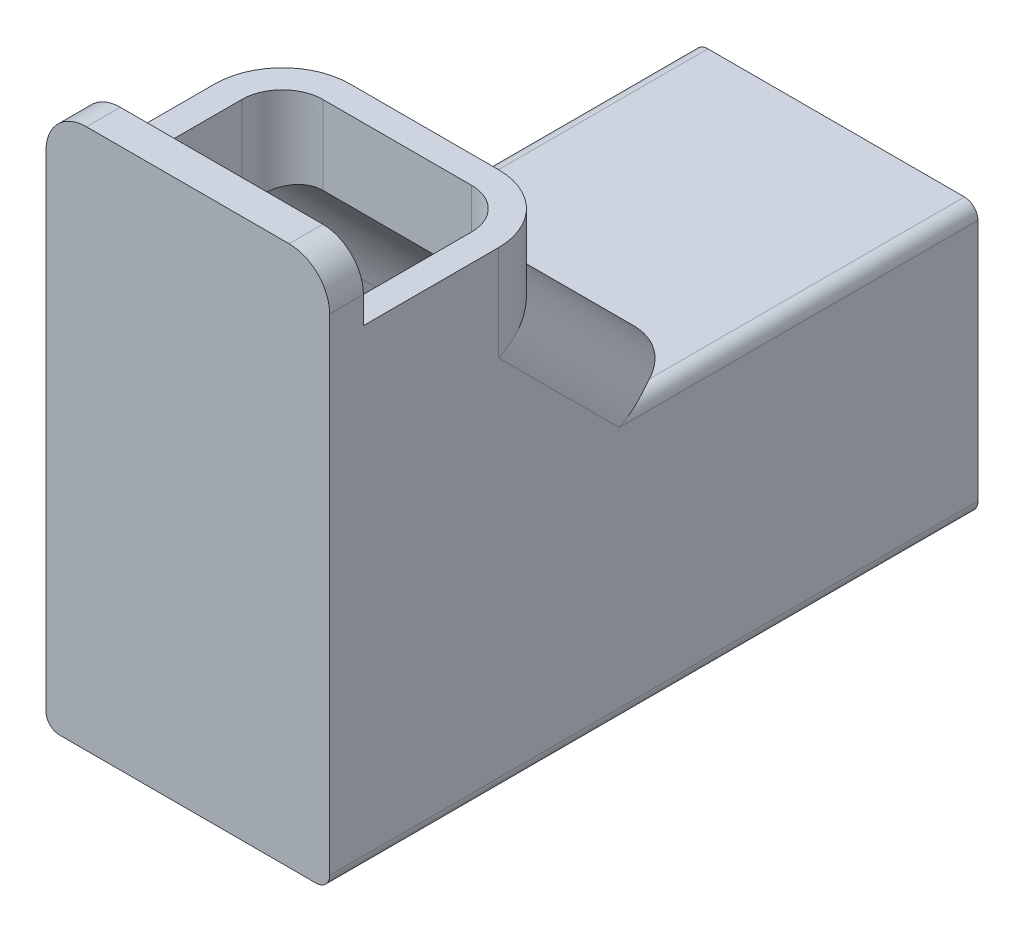
ISO-10303-21;
HEADER;
FILE_DESCRIPTION(('STEP AP214'),'2;1');
FILE_NAME('part.step','',(''),(''),'','','');
FILE_SCHEMA(('AUTOMOTIVE_DESIGN { 1 0 10303 214 1 1 1 1 }'));
ENDSEC;
DATA;
#1=APPLICATION_CONTEXT('core data for automotive mechanical design processes');
#2=APPLICATION_PROTOCOL_DEFINITION('international standard','automotive_design',2000,#1);
#3=PRODUCT_CONTEXT('',#1,'mechanical');
#4=PRODUCT('Part','Part','',(#3));
#5=PRODUCT_RELATED_PRODUCT_CATEGORY('part','',(#4));
#6=PRODUCT_DEFINITION_FORMATION('','',#4);
#7=PRODUCT_DEFINITION_CONTEXT('part definition',#1,'design');
#8=PRODUCT_DEFINITION('design','',#6,#7);
#9=PRODUCT_DEFINITION_SHAPE('','',#8);
#10=(LENGTH_UNIT() NAMED_UNIT(*) SI_UNIT(.MILLI.,.METRE.));
#11=(NAMED_UNIT(*) PLANE_ANGLE_UNIT() SI_UNIT($,.RADIAN.));
#12=(NAMED_UNIT(*) SI_UNIT($,.STERADIAN.) SOLID_ANGLE_UNIT());
#13=UNCERTAINTY_MEASURE_WITH_UNIT(LENGTH_MEASURE(1.E-05),#10,'distance_accuracy_value','');
#14=(GEOMETRIC_REPRESENTATION_CONTEXT(3) GLOBAL_UNCERTAINTY_ASSIGNED_CONTEXT((#13)) GLOBAL_UNIT_ASSIGNED_CONTEXT((#10,
#11,#12)) REPRESENTATION_CONTEXT('',''));
#15=CARTESIAN_POINT('',(0.,0.,0.));
#16=DIRECTION('',(0.,0.,1.));
#17=DIRECTION('',(1.,0.,0.));
#18=AXIS2_PLACEMENT_3D('',#15,#16,#17);
#19=CARTESIAN_POINT('',(21.,20.,-48.));
#20=DIRECTION('',(0.,0.,1.));
#21=DIRECTION('',(1.,0.,0.));
#22=AXIS2_PLACEMENT_3D('',#19,#20,#21);
#23=PLANE('',#22);
#24=DIRECTION('',(-1.,0.,0.));
#25=VECTOR('',#24,1.);
#26=CARTESIAN_POINT('',(21.,0.,-48.));
#27=LINE('',#26,#25);
#28=CARTESIAN_POINT('',(20.,0.,-48.));
#29=VERTEX_POINT('',#28);
#30=CARTESIAN_POINT('',(1.00000000000001,0.,-48.));
#31=VERTEX_POINT('',#30);
#32=EDGE_CURVE('E478',#29,#31,#27,.T.);
#33=ORIENTED_EDGE('',*,*,#32,.T.);
#34=CARTESIAN_POINT('',(1.,1.,-48.));
#35=DIRECTION('',(0.,0.,1.));
#36=DIRECTION('',(1.,0.,0.));
#37=AXIS2_PLACEMENT_3D('',#34,#35,#36);
#38=CIRCLE('',#37,1.);
#39=CARTESIAN_POINT('',(0.,1.,-48.));
#40=VERTEX_POINT('',#39);
#41=EDGE_CURVE('E498',#31,#40,#38,.F.);
#42=ORIENTED_EDGE('',*,*,#41,.T.);
#43=DIRECTION('',(0.,1.,0.));
#44=VECTOR('',#43,1.);
#45=CARTESIAN_POINT('',(0.,20.,-48.));
#46=LINE('',#45,#44);
#47=CARTESIAN_POINT('',(0.,19.,-48.));
#48=VERTEX_POINT('',#47);
#49=EDGE_CURVE('E415',#40,#48,#46,.T.);
#50=ORIENTED_EDGE('',*,*,#49,.T.);
#51=CARTESIAN_POINT('',(1.,19.,-48.));
#52=DIRECTION('',(0.,0.,1.));
#53=DIRECTION('',(1.,0.,0.));
#54=AXIS2_PLACEMENT_3D('',#51,#52,#53);
#55=CIRCLE('',#54,1.);
#56=CARTESIAN_POINT('',(1.00000000000001,20.,-48.));
#57=VERTEX_POINT('',#56);
#58=EDGE_CURVE('E492',#48,#57,#55,.F.);
#59=ORIENTED_EDGE('',*,*,#58,.T.);
#60=DIRECTION('',(-1.,0.,0.));
#61=VECTOR('',#60,1.);
#62=CARTESIAN_POINT('',(21.,20.,-48.));
#63=LINE('',#62,#61);
#64=CARTESIAN_POINT('',(20.,20.,-48.));
#65=VERTEX_POINT('',#64);
#66=EDGE_CURVE('E474',#65,#57,#63,.T.);
#67=ORIENTED_EDGE('',*,*,#66,.F.);
#68=CARTESIAN_POINT('',(20.,19.,-48.));
#69=DIRECTION('',(0.,0.,1.));
#70=DIRECTION('',(1.,0.,0.));
#71=AXIS2_PLACEMENT_3D('',#68,#69,#70);
#72=CIRCLE('',#71,1.);
#73=CARTESIAN_POINT('',(21.,19.,-48.));
#74=VERTEX_POINT('',#73);
#75=EDGE_CURVE('E489',#65,#74,#72,.F.);
#76=ORIENTED_EDGE('',*,*,#75,.T.);
#77=DIRECTION('',(0.,1.,0.));
#78=VECTOR('',#77,1.);
#79=CARTESIAN_POINT('',(21.,20.,-48.));
#80=LINE('',#79,#78);
#81=CARTESIAN_POINT('',(21.,1.,-48.));
#82=VERTEX_POINT('',#81);
#83=EDGE_CURVE('E416',#82,#74,#80,.T.);
#84=ORIENTED_EDGE('',*,*,#83,.F.);
#85=CARTESIAN_POINT('',(20.,1.,-48.));
#86=DIRECTION('',(0.,0.,1.));
#87=DIRECTION('',(1.,0.,0.));
#88=AXIS2_PLACEMENT_3D('',#85,#86,#87);
#89=CIRCLE('',#88,1.);
#90=EDGE_CURVE('E495',#82,#29,#89,.F.);
#91=ORIENTED_EDGE('',*,*,#90,.T.);
#92=EDGE_LOOP('',(#33,#42,#50,#59,#67,#76,#84,#91));
#93=FACE_BOUND('',#92,.T.);
#94=DIRECTION('',(-1.,0.,0.));
#95=VECTOR('',#94,1.);
#96=CARTESIAN_POINT('',(21.,2.,-48.));
#97=LINE('',#96,#95);
#98=CARTESIAN_POINT('',(19.,2.,-48.));
#99=VERTEX_POINT('',#98);
#100=CARTESIAN_POINT('',(2.,2.,-48.));
#101=VERTEX_POINT('',#100);
#102=EDGE_CURVE('E319',#99,#101,#97,.T.);
#103=ORIENTED_EDGE('',*,*,#102,.F.);
#104=DIRECTION('',(0.,1.,0.));
#105=VECTOR('',#104,1.);
#106=CARTESIAN_POINT('',(19.,0.,-48.));
#107=LINE('',#106,#105);
#108=CARTESIAN_POINT('',(19.,18.,-48.));
#109=VERTEX_POINT('',#108);
#110=EDGE_CURVE('E314',#99,#109,#107,.T.);
#111=ORIENTED_EDGE('',*,*,#110,.T.);
#112=DIRECTION('',(-1.,0.,0.));
#113=VECTOR('',#112,1.);
#114=CARTESIAN_POINT('',(21.,18.,-48.));
#115=LINE('',#114,#113);
#116=CARTESIAN_POINT('',(2.,18.,-48.));
#117=VERTEX_POINT('',#116);
#118=EDGE_CURVE('E59',#109,#117,#115,.T.);
#119=ORIENTED_EDGE('',*,*,#118,.T.);
#120=DIRECTION('',(0.,1.,0.));
#121=VECTOR('',#120,1.);
#122=CARTESIAN_POINT('',(2.,0.,-48.));
#123=LINE('',#122,#121);
#124=EDGE_CURVE('E392',#101,#117,#123,.T.);
#125=ORIENTED_EDGE('',*,*,#124,.F.);
#126=EDGE_LOOP('',(#103,#111,#119,#125));
#127=FACE_BOUND('',#126,.T.);
#128=ADVANCED_FACE('F40',(#93,#127),#23,.F.);
#129=CARTESIAN_POINT('',(21.,0.,-48.));
#130=DIRECTION('',(0.,1.,0.));
#131=DIRECTION('',(0.,0.,1.));
#132=AXIS2_PLACEMENT_3D('',#129,#130,#131);
#133=PLANE('',#132);
#134=DIRECTION('',(-1.,0.,0.));
#135=VECTOR('',#134,1.);
#136=CARTESIAN_POINT('',(21.,0.,0.));
#137=LINE('',#136,#135);
#138=CARTESIAN_POINT('',(20.,0.,0.));
#139=VERTEX_POINT('',#138);
#140=CARTESIAN_POINT('',(1.00000000000001,0.,0.));
#141=VERTEX_POINT('',#140);
#142=EDGE_CURVE('E431',#139,#141,#137,.T.);
#143=ORIENTED_EDGE('',*,*,#142,.T.);
#144=DIRECTION('',(0.,0.,-1.));
#145=VECTOR('',#144,1.);
#146=CARTESIAN_POINT('',(1.,0.,-48.));
#147=LINE('',#146,#145);
#148=EDGE_CURVE('E485',#141,#31,#147,.T.);
#149=ORIENTED_EDGE('',*,*,#148,.T.);
#150=ORIENTED_EDGE('',*,*,#32,.F.);
#151=DIRECTION('',(0.,0.,-1.));
#152=VECTOR('',#151,1.);
#153=CARTESIAN_POINT('',(20.,0.,-48.));
#154=LINE('',#153,#152);
#155=EDGE_CURVE('E482',#29,#139,#154,.F.);
#156=ORIENTED_EDGE('',*,*,#155,.T.);
#157=EDGE_LOOP('',(#143,#149,#150,#156));
#158=FACE_BOUND('',#157,.T.);
#159=ADVANCED_FACE('F623',(#158),#133,.F.);
#160=CARTESIAN_POINT('',(21.,20.,-27.5));
#161=DIRECTION('',(0.,-1.,0.));
#162=DIRECTION('',(0.,0.,-1.));
#163=AXIS2_PLACEMENT_3D('',#160,#161,#162);
#164=PLANE('',#163);
#165=ORIENTED_EDGE('',*,*,#66,.T.);
#166=DIRECTION('',(0.,0.,1.));
#167=VECTOR('',#166,1.);
#168=CARTESIAN_POINT('',(1.,20.,-27.5));
#169=LINE('',#168,#167);
#170=CARTESIAN_POINT('',(1.,20.,-24.6715728752538));
#171=VERTEX_POINT('',#170);
#172=EDGE_CURVE('E525',#57,#171,#169,.T.);
#173=ORIENTED_EDGE('',*,*,#172,.T.);
#174=CARTESIAN_POINT('',(5.,20.,-20.4289321881345));
#175=DIRECTION('',(0.,-1.,0.));
#176=DIRECTION('',(0.,0.,-1.));
#177=AXIS2_PLACEMENT_3D('',#174,#175,#176);
#178=ELLIPSE('',#177,7.07106781186546,5.);
#179=CARTESIAN_POINT('',(5.00000000000001,20.,-27.5));
#180=VERTEX_POINT('',#179);
#181=EDGE_CURVE('E578',#171,#180,#178,.T.);
#182=ORIENTED_EDGE('',*,*,#181,.T.);
#183=DIRECTION('',(-1.,0.,0.));
#184=VECTOR('',#183,1.);
#185=CARTESIAN_POINT('',(21.,20.,-27.5));
#186=LINE('',#185,#184);
#187=CARTESIAN_POINT('',(16.,20.,-27.5));
#188=VERTEX_POINT('',#187);
#189=EDGE_CURVE('E470',#188,#180,#186,.T.);
#190=ORIENTED_EDGE('',*,*,#189,.F.);
#191=CARTESIAN_POINT('',(16.,20.,-20.4289321881345));
#192=DIRECTION('',(0.,-1.,0.));
#193=DIRECTION('',(0.,0.,1.));
#194=AXIS2_PLACEMENT_3D('',#191,#192,#193);
#195=ELLIPSE('',#194,7.07106781186546,5.);
#196=CARTESIAN_POINT('',(20.,20.,-24.6715728752538));
#197=VERTEX_POINT('',#196);
#198=EDGE_CURVE('E608',#188,#197,#195,.T.);
#199=ORIENTED_EDGE('',*,*,#198,.T.);
#200=DIRECTION('',(0.,0.,1.));
#201=VECTOR('',#200,1.);
#202=CARTESIAN_POINT('',(20.,20.,-27.5));
#203=LINE('',#202,#201);
#204=EDGE_CURVE('E522',#197,#65,#203,.F.);
#205=ORIENTED_EDGE('',*,*,#204,.T.);
#206=EDGE_LOOP('',(#165,#173,#182,#190,#199,#205));
#207=FACE_BOUND('',#206,.T.);
#208=ADVANCED_FACE('F629',(#207),#164,.F.);
#209=CARTESIAN_POINT('',(21.,30.,-17.5));
#210=DIRECTION('',(0.,-0.707106781186546,0.707106781186549));
#211=DIRECTION('',(0.,-0.707106781186549,-0.707106781186546));
#212=AXIS2_PLACEMENT_3D('',#209,#210,#211);
#213=PLANE('',#212);
#214=ORIENTED_EDGE('',*,*,#189,.T.);
#215=DIRECTION('',(0.,0.707106781186549,0.707106781186546));
#216=VECTOR('',#215,1.);
#217=CARTESIAN_POINT('',(5.,35.,-12.5));
#218=LINE('',#217,#216);
#219=CARTESIAN_POINT('',(5.00000000000001,30.,-17.5));
#220=VERTEX_POINT('',#219);
#221=EDGE_CURVE('E546',#180,#220,#218,.T.);
#222=ORIENTED_EDGE('',*,*,#221,.T.);
#223=DIRECTION('',(-1.,0.,0.));
#224=VECTOR('',#223,1.);
#225=CARTESIAN_POINT('',(21.,30.,-17.5));
#226=LINE('',#225,#224);
#227=CARTESIAN_POINT('',(16.,30.,-17.5));
#228=VERTEX_POINT('',#227);
#229=EDGE_CURVE('E466',#228,#220,#226,.T.);
#230=ORIENTED_EDGE('',*,*,#229,.F.);
#231=DIRECTION('',(0.,0.707106781186549,0.707106781186546));
#232=VECTOR('',#231,1.);
#233=CARTESIAN_POINT('',(16.,30.,-17.5));
#234=LINE('',#233,#232);
#235=EDGE_CURVE('E543',#228,#188,#234,.F.);
#236=ORIENTED_EDGE('',*,*,#235,.T.);
#237=EDGE_LOOP('',(#214,#222,#230,#236));
#238=FACE_BOUND('',#237,.T.);
#239=ADVANCED_FACE('F722',(#238),#213,.F.);
#240=CARTESIAN_POINT('',(21.,35.,-17.5));
#241=DIRECTION('',(0.,0.,1.));
#242=DIRECTION('',(1.,0.,0.));
#243=AXIS2_PLACEMENT_3D('',#240,#241,#242);
#244=PLANE('',#243);
#245=ORIENTED_EDGE('',*,*,#229,.T.);
#246=DIRECTION('',(0.,1.,0.));
#247=VECTOR('',#246,1.);
#248=CARTESIAN_POINT('',(5.,35.,-17.5));
#249=LINE('',#248,#247);
#250=CARTESIAN_POINT('',(5.00000000000001,35.,-17.5));
#251=VERTEX_POINT('',#250);
#252=EDGE_CURVE('E532',#220,#251,#249,.T.);
#253=ORIENTED_EDGE('',*,*,#252,.T.);
#254=DIRECTION('',(-1.,0.,0.));
#255=VECTOR('',#254,1.);
#256=CARTESIAN_POINT('',(21.,35.,-17.5));
#257=LINE('',#256,#255);
#258=CARTESIAN_POINT('',(16.,35.,-17.5));
#259=VERTEX_POINT('',#258);
#260=EDGE_CURVE('E461',#259,#251,#257,.T.);
#261=ORIENTED_EDGE('',*,*,#260,.F.);
#262=DIRECTION('',(0.,1.,0.));
#263=VECTOR('',#262,1.);
#264=CARTESIAN_POINT('',(16.,35.,-17.5));
#265=LINE('',#264,#263);
#266=EDGE_CURVE('E528',#259,#228,#265,.F.);
#267=ORIENTED_EDGE('',*,*,#266,.T.);
#268=EDGE_LOOP('',(#245,#253,#261,#267));
#269=FACE_BOUND('',#268,.T.);
#270=ADVANCED_FACE('F717',(#269),#244,.F.);
#271=CARTESIAN_POINT('',(21.,35.,-2.5));
#272=DIRECTION('',(0.,-1.,0.));
#273=DIRECTION('',(0.,0.,-1.));
#274=AXIS2_PLACEMENT_3D('',#271,#272,#273);
#275=PLANE('',#274);
#276=DIRECTION('',(0.,0.,1.));
#277=VECTOR('',#276,1.);
#278=CARTESIAN_POINT('',(2.,35.,0.));
#279=LINE('',#278,#277);
#280=CARTESIAN_POINT('',(2.,35.,-12.5));
#281=VERTEX_POINT('',#280);
#282=CARTESIAN_POINT('',(2.,35.,-2.5));
#283=VERTEX_POINT('',#282);
#284=EDGE_CURVE('E315',#281,#283,#279,.T.);
#285=ORIENTED_EDGE('',*,*,#284,.F.);
#286=CARTESIAN_POINT('',(5.,35.,-12.5));
#287=DIRECTION('',(0.,-1.,0.));
#288=DIRECTION('',(0.,0.,-1.));
#289=AXIS2_PLACEMENT_3D('',#286,#287,#288);
#290=CIRCLE('',#289,3.);
#291=CARTESIAN_POINT('',(5.00000000000001,35.,-15.5));
#292=VERTEX_POINT('',#291);
#293=EDGE_CURVE('E372',#292,#281,#290,.F.);
#294=ORIENTED_EDGE('',*,*,#293,.F.);
#295=DIRECTION('',(-1.,0.,0.));
#296=VECTOR('',#295,1.);
#297=CARTESIAN_POINT('',(21.,35.,-15.5));
#298=LINE('',#297,#296);
#299=CARTESIAN_POINT('',(16.,35.,-15.5));
#300=VERTEX_POINT('',#299);
#301=EDGE_CURVE('E70',#300,#292,#298,.T.);
#302=ORIENTED_EDGE('',*,*,#301,.F.);
#303=CARTESIAN_POINT('',(16.,35.,-12.5));
#304=DIRECTION('',(0.,-1.,0.));
#305=DIRECTION('',(0.,0.,-1.));
#306=AXIS2_PLACEMENT_3D('',#303,#304,#305);
#307=CIRCLE('',#306,3.);
#308=CARTESIAN_POINT('',(19.,35.,-12.5));
#309=VERTEX_POINT('',#308);
#310=EDGE_CURVE('E376',#309,#300,#307,.F.);
#311=ORIENTED_EDGE('',*,*,#310,.F.);
#312=DIRECTION('',(0.,0.,1.));
#313=VECTOR('',#312,1.);
#314=CARTESIAN_POINT('',(19.,35.,0.));
#315=LINE('',#314,#313);
#316=CARTESIAN_POINT('',(19.,35.,-2.5));
#317=VERTEX_POINT('',#316);
#318=EDGE_CURVE('E336',#309,#317,#315,.T.);
#319=ORIENTED_EDGE('',*,*,#318,.T.);
#320=DIRECTION('',(-1.,0.,0.));
#321=VECTOR('',#320,1.);
#322=CARTESIAN_POINT('',(21.,35.,-2.5));
#323=LINE('',#322,#321);
#324=CARTESIAN_POINT('',(21.,35.,-2.5));
#325=VERTEX_POINT('',#324);
#326=EDGE_CURVE('E457',#325,#317,#323,.T.);
#327=ORIENTED_EDGE('',*,*,#326,.F.);
#328=DIRECTION('',(0.,0.,1.));
#329=VECTOR('',#328,1.);
#330=CARTESIAN_POINT('',(21.,35.,-2.5));
#331=LINE('',#330,#329);
#332=CARTESIAN_POINT('',(21.,35.,-12.5));
#333=VERTEX_POINT('',#332);
#334=EDGE_CURVE('E420',#333,#325,#331,.T.);
#335=ORIENTED_EDGE('',*,*,#334,.F.);
#336=CARTESIAN_POINT('',(16.,35.,-12.5));
#337=DIRECTION('',(0.,-1.,0.));
#338=DIRECTION('',(0.,0.,-1.));
#339=AXIS2_PLACEMENT_3D('',#336,#337,#338);
#340=CIRCLE('',#339,5.);
#341=EDGE_CURVE('E536',#333,#259,#340,.F.);
#342=ORIENTED_EDGE('',*,*,#341,.T.);
#343=ORIENTED_EDGE('',*,*,#260,.T.);
#344=CARTESIAN_POINT('',(5.,35.,-12.5));
#345=DIRECTION('',(0.,-1.,0.));
#346=DIRECTION('',(0.,0.,-1.));
#347=AXIS2_PLACEMENT_3D('',#344,#345,#346);
#348=CIRCLE('',#347,5.);
#349=CARTESIAN_POINT('',(0.,35.,-12.5));
#350=VERTEX_POINT('',#349);
#351=EDGE_CURVE('E539',#251,#350,#348,.F.);
#352=ORIENTED_EDGE('',*,*,#351,.T.);
#353=DIRECTION('',(0.,0.,1.));
#354=VECTOR('',#353,1.);
#355=CARTESIAN_POINT('',(0.,35.,-2.5));
#356=LINE('',#355,#354);
#357=CARTESIAN_POINT('',(0.,35.,-2.5));
#358=VERTEX_POINT('',#357);
#359=EDGE_CURVE('E435',#350,#358,#356,.T.);
#360=ORIENTED_EDGE('',*,*,#359,.T.);
#361=EDGE_CURVE('E456',#283,#358,#323,.T.);
#362=ORIENTED_EDGE('',*,*,#361,.F.);
#363=EDGE_LOOP('',(#285,#294,#302,#311,#319,#327,#335,#342,#343,#352,#360,#362));
#364=FACE_BOUND('',#363,.T.);
#365=ADVANCED_FACE('F714',(#364),#275,.F.);
#366=CARTESIAN_POINT('',(21.,40.,-2.5));
#367=DIRECTION('',(0.,0.,1.));
#368=DIRECTION('',(1.,0.,0.));
#369=AXIS2_PLACEMENT_3D('',#366,#367,#368);
#370=PLANE('',#369);
#371=DIRECTION('',(0.,1.,0.));
#372=VECTOR('',#371,1.);
#373=CARTESIAN_POINT('',(0.,40.,-2.5));
#374=LINE('',#373,#372);
#375=CARTESIAN_POINT('',(0.,37.,-2.5));
#376=VERTEX_POINT('',#375);
#377=EDGE_CURVE('E439',#358,#376,#374,.T.);
#378=ORIENTED_EDGE('',*,*,#377,.T.);
#379=CARTESIAN_POINT('',(3.,37.,-2.5));
#380=DIRECTION('',(0.,0.,1.));
#381=DIRECTION('',(1.,0.,0.));
#382=AXIS2_PLACEMENT_3D('',#379,#380,#381);
#383=CIRCLE('',#382,3.);
#384=CARTESIAN_POINT('',(3.00000000000001,40.,-2.5));
#385=VERTEX_POINT('',#384);
#386=EDGE_CURVE('E49',#376,#385,#383,.F.);
#387=ORIENTED_EDGE('',*,*,#386,.T.);
#388=DIRECTION('',(-1.,0.,0.));
#389=VECTOR('',#388,1.);
#390=CARTESIAN_POINT('',(21.,40.,-2.5));
#391=LINE('',#390,#389);
#392=CARTESIAN_POINT('',(18.,40.,-2.5));
#393=VERTEX_POINT('',#392);
#394=EDGE_CURVE('E452',#393,#385,#391,.T.);
#395=ORIENTED_EDGE('',*,*,#394,.F.);
#396=CARTESIAN_POINT('',(18.,37.,-2.5));
#397=DIRECTION('',(0.,0.,1.));
#398=DIRECTION('',(1.,0.,0.));
#399=AXIS2_PLACEMENT_3D('',#396,#397,#398);
#400=CIRCLE('',#399,3.);
#401=CARTESIAN_POINT('',(21.,37.,-2.5));
#402=VERTEX_POINT('',#401);
#403=EDGE_CURVE('E683',#393,#402,#400,.F.);
#404=ORIENTED_EDGE('',*,*,#403,.T.);
#405=DIRECTION('',(0.,1.,0.));
#406=VECTOR('',#405,1.);
#407=CARTESIAN_POINT('',(21.,40.,-2.5));
#408=LINE('',#407,#406);
#409=EDGE_CURVE('E424',#325,#402,#408,.T.);
#410=ORIENTED_EDGE('',*,*,#409,.F.);
#411=ORIENTED_EDGE('',*,*,#326,.T.);
#412=EDGE_CURVE('E462',#317,#283,#323,.T.);
#413=ORIENTED_EDGE('',*,*,#412,.T.);
#414=ORIENTED_EDGE('',*,*,#361,.T.);
#415=EDGE_LOOP('',(#378,#387,#395,#404,#410,#411,#413,#414));
#416=FACE_BOUND('',#415,.T.);
#417=ADVANCED_FACE('F703',(#416),#370,.F.);
#418=CARTESIAN_POINT('',(21.,40.,0.));
#419=DIRECTION('',(0.,-1.,0.));
#420=DIRECTION('',(0.,0.,-1.));
#421=AXIS2_PLACEMENT_3D('',#418,#419,#420);
#422=PLANE('',#421);
#423=ORIENTED_EDGE('',*,*,#394,.T.);
#424=DIRECTION('',(0.,0.,1.));
#425=VECTOR('',#424,1.);
#426=CARTESIAN_POINT('',(3.,40.,0.));
#427=LINE('',#426,#425);
#428=CARTESIAN_POINT('',(3.00000000000001,40.,0.));
#429=VERTEX_POINT('',#428);
#430=EDGE_CURVE('E688',#385,#429,#427,.T.);
#431=ORIENTED_EDGE('',*,*,#430,.T.);
#432=DIRECTION('',(-1.,0.,0.));
#433=VECTOR('',#432,1.);
#434=CARTESIAN_POINT('',(21.,40.,0.));
#435=LINE('',#434,#433);
#436=CARTESIAN_POINT('',(18.,40.,0.));
#437=VERTEX_POINT('',#436);
#438=EDGE_CURVE('E448',#437,#429,#435,.T.);
#439=ORIENTED_EDGE('',*,*,#438,.F.);
#440=DIRECTION('',(0.,0.,1.));
#441=VECTOR('',#440,1.);
#442=CARTESIAN_POINT('',(18.,40.,0.));
#443=LINE('',#442,#441);
#444=EDGE_CURVE('E607',#437,#393,#443,.F.);
#445=ORIENTED_EDGE('',*,*,#444,.T.);
#446=EDGE_LOOP('',(#423,#431,#439,#445));
#447=FACE_BOUND('',#446,.T.);
#448=ADVANCED_FACE('F709',(#447),#422,.F.);
#449=CARTESIAN_POINT('',(21.,0.,0.));
#450=DIRECTION('',(0.,0.,-1.));
#451=DIRECTION('',(-1.,0.,0.));
#452=AXIS2_PLACEMENT_3D('',#449,#450,#451);
#453=PLANE('',#452);
#454=ORIENTED_EDGE('',*,*,#438,.T.);
#455=CARTESIAN_POINT('',(3.,37.,0.));
#456=DIRECTION('',(0.,0.,-1.));
#457=DIRECTION('',(-1.,0.,0.));
#458=AXIS2_PLACEMENT_3D('',#455,#456,#457);
#459=CIRCLE('',#458,3.);
#460=CARTESIAN_POINT('',(0.,37.,0.));
#461=VERTEX_POINT('',#460);
#462=EDGE_CURVE('E687',#429,#461,#459,.F.);
#463=ORIENTED_EDGE('',*,*,#462,.T.);
#464=DIRECTION('',(0.,-1.,0.));
#465=VECTOR('',#464,1.);
#466=CARTESIAN_POINT('',(0.,0.,0.));
#467=LINE('',#466,#465);
#468=CARTESIAN_POINT('',(0.,1.,0.));
#469=VERTEX_POINT('',#468);
#470=EDGE_CURVE('E421',#461,#469,#467,.T.);
#471=ORIENTED_EDGE('',*,*,#470,.T.);
#472=CARTESIAN_POINT('',(1.,1.,0.));
#473=DIRECTION('',(0.,0.,-1.));
#474=DIRECTION('',(-1.,0.,0.));
#475=AXIS2_PLACEMENT_3D('',#472,#473,#474);
#476=CIRCLE('',#475,1.);
#477=EDGE_CURVE('E512',#469,#141,#476,.F.);
#478=ORIENTED_EDGE('',*,*,#477,.T.);
#479=ORIENTED_EDGE('',*,*,#142,.F.);
#480=CARTESIAN_POINT('',(20.,1.,0.));
#481=DIRECTION('',(0.,0.,-1.));
#482=DIRECTION('',(-1.,0.,0.));
#483=AXIS2_PLACEMENT_3D('',#480,#481,#482);
#484=CIRCLE('',#483,1.);
#485=CARTESIAN_POINT('',(21.,1.,0.));
#486=VERTEX_POINT('',#485);
#487=EDGE_CURVE('E508',#139,#486,#484,.F.);
#488=ORIENTED_EDGE('',*,*,#487,.T.);
#489=DIRECTION('',(0.,-1.,0.));
#490=VECTOR('',#489,1.);
#491=CARTESIAN_POINT('',(21.,0.,0.));
#492=LINE('',#491,#490);
#493=CARTESIAN_POINT('',(21.,37.,0.));
#494=VERTEX_POINT('',#493);
#495=EDGE_CURVE('E428',#494,#486,#492,.T.);
#496=ORIENTED_EDGE('',*,*,#495,.F.);
#497=CARTESIAN_POINT('',(18.,37.,0.));
#498=DIRECTION('',(0.,0.,-1.));
#499=DIRECTION('',(-1.,0.,0.));
#500=AXIS2_PLACEMENT_3D('',#497,#498,#499);
#501=CIRCLE('',#500,3.);
#502=EDGE_CURVE('E684',#494,#437,#501,.F.);
#503=ORIENTED_EDGE('',*,*,#502,.T.);
#504=EDGE_LOOP('',(#454,#463,#471,#478,#479,#488,#496,#503));
#505=FACE_BOUND('',#504,.T.);
#506=ADVANCED_FACE('F653',(#505),#453,.F.);
#507=CARTESIAN_POINT('',(21.,0.,0.));
#508=DIRECTION('',(-1.,0.,0.));
#509=DIRECTION('',(0.,0.,1.));
#510=AXIS2_PLACEMENT_3D('',#507,#508,#509);
#511=PLANE('',#510);
#512=ORIENTED_EDGE('',*,*,#409,.T.);
#513=DIRECTION('',(0.,0.,1.));
#514=VECTOR('',#513,1.);
#515=CARTESIAN_POINT('',(21.,37.,0.));
#516=LINE('',#515,#514);
#517=EDGE_CURVE('E11',#402,#494,#516,.T.);
#518=ORIENTED_EDGE('',*,*,#517,.T.);
#519=ORIENTED_EDGE('',*,*,#495,.T.);
#520=DIRECTION('',(0.,0.,-1.));
#521=VECTOR('',#520,1.);
#522=CARTESIAN_POINT('',(21.,1.,0.));
#523=LINE('',#522,#521);
#524=EDGE_CURVE('E518',#486,#82,#523,.T.);
#525=ORIENTED_EDGE('',*,*,#524,.T.);
#526=ORIENTED_EDGE('',*,*,#83,.T.);
#527=DIRECTION('',(0.,0.,1.));
#528=VECTOR('',#527,1.);
#529=CARTESIAN_POINT('',(21.,19.,0.));
#530=LINE('',#529,#528);
#531=CARTESIAN_POINT('',(21.,19.,-21.4289321881345));
#532=VERTEX_POINT('',#531);
#533=EDGE_CURVE('E515',#74,#532,#530,.T.);
#534=ORIENTED_EDGE('',*,*,#533,.T.);
#535=DIRECTION('',(0.,0.707106781186549,0.707106781186546));
#536=VECTOR('',#535,1.);
#537=CARTESIAN_POINT('',(21.,20.2144660940672,-20.2144660940673));
#538=LINE('',#537,#536);
#539=CARTESIAN_POINT('',(21.,27.9289321881345,-12.5));
#540=VERTEX_POINT('',#539);
#541=EDGE_CURVE('E558',#532,#540,#538,.T.);
#542=ORIENTED_EDGE('',*,*,#541,.T.);
#543=DIRECTION('',(0.,1.,0.));
#544=VECTOR('',#543,1.);
#545=CARTESIAN_POINT('',(21.,31.4644660940673,-12.5));
#546=LINE('',#545,#544);
#547=EDGE_CURVE('E562',#540,#333,#546,.T.);
#548=ORIENTED_EDGE('',*,*,#547,.T.);
#549=ORIENTED_EDGE('',*,*,#334,.T.);
#550=EDGE_LOOP('',(#512,#518,#519,#525,#526,#534,#542,#548,#549));
#551=FACE_BOUND('',#550,.T.);
#552=ADVANCED_FACE('F677',(#551),#511,.F.);
#553=CARTESIAN_POINT('',(0.,0.,0.));
#554=DIRECTION('',(-1.,0.,0.));
#555=DIRECTION('',(0.,0.,1.));
#556=AXIS2_PLACEMENT_3D('',#553,#554,#555);
#557=PLANE('',#556);
#558=ORIENTED_EDGE('',*,*,#470,.F.);
#559=DIRECTION('',(0.,0.,1.));
#560=VECTOR('',#559,1.);
#561=CARTESIAN_POINT('',(0.,37.,-2.5));
#562=LINE('',#561,#560);
#563=EDGE_CURVE('E691',#461,#376,#562,.F.);
#564=ORIENTED_EDGE('',*,*,#563,.T.);
#565=ORIENTED_EDGE('',*,*,#377,.F.);
#566=ORIENTED_EDGE('',*,*,#359,.F.);
#567=DIRECTION('',(0.,-1.,0.));
#568=VECTOR('',#567,1.);
#569=CARTESIAN_POINT('',(0.,31.4644660940673,-12.5));
#570=LINE('',#569,#568);
#571=CARTESIAN_POINT('',(0.,27.9289321881345,-12.5));
#572=VERTEX_POINT('',#571);
#573=EDGE_CURVE('E554',#350,#572,#570,.T.);
#574=ORIENTED_EDGE('',*,*,#573,.T.);
#575=DIRECTION('',(0.,0.707106781186549,0.707106781186546));
#576=VECTOR('',#575,1.);
#577=CARTESIAN_POINT('',(0.,15.4644660940673,-24.9644660940672));
#578=LINE('',#577,#576);
#579=CARTESIAN_POINT('',(0.,19.,-21.4289321881345));
#580=VERTEX_POINT('',#579);
#581=EDGE_CURVE('E550',#572,#580,#578,.F.);
#582=ORIENTED_EDGE('',*,*,#581,.T.);
#583=DIRECTION('',(0.,0.,1.));
#584=VECTOR('',#583,1.);
#585=CARTESIAN_POINT('',(0.,19.,-48.));
#586=LINE('',#585,#584);
#587=EDGE_CURVE('E501',#580,#48,#586,.F.);
#588=ORIENTED_EDGE('',*,*,#587,.T.);
#589=ORIENTED_EDGE('',*,*,#49,.F.);
#590=DIRECTION('',(0.,0.,-1.));
#591=VECTOR('',#590,1.);
#592=CARTESIAN_POINT('',(0.,1.,0.));
#593=LINE('',#592,#591);
#594=EDGE_CURVE('E504',#40,#469,#593,.F.);
#595=ORIENTED_EDGE('',*,*,#594,.T.);
#596=EDGE_LOOP('',(#558,#564,#565,#566,#574,#582,#588,#589,#595));
#597=FACE_BOUND('',#596,.T.);
#598=ADVANCED_FACE('F639',(#597),#557,.T.);
#599=CARTESIAN_POINT('',(1.,1.,-48.));
#600=DIRECTION('',(0.,0.,1.));
#601=DIRECTION('',(1.,0.,0.));
#602=AXIS2_PLACEMENT_3D('',#599,#600,#601);
#603=CYLINDRICAL_SURFACE('',#602,1.);
#604=ORIENTED_EDGE('',*,*,#477,.F.);
#605=ORIENTED_EDGE('',*,*,#594,.F.);
#606=ORIENTED_EDGE('',*,*,#41,.F.);
#607=ORIENTED_EDGE('',*,*,#148,.F.);
#608=EDGE_LOOP('',(#604,#605,#606,#607));
#609=FACE_BOUND('',#608,.T.);
#610=ADVANCED_FACE('F636',(#609),#603,.T.);
#611=CARTESIAN_POINT('',(20.,1.,0.));
#612=DIRECTION('',(0.,0.,-1.));
#613=DIRECTION('',(-1.,0.,0.));
#614=AXIS2_PLACEMENT_3D('',#611,#612,#613);
#615=CYLINDRICAL_SURFACE('',#614,1.);
#616=ORIENTED_EDGE('',*,*,#487,.F.);
#617=ORIENTED_EDGE('',*,*,#155,.F.);
#618=ORIENTED_EDGE('',*,*,#90,.F.);
#619=ORIENTED_EDGE('',*,*,#524,.F.);
#620=EDGE_LOOP('',(#616,#617,#618,#619));
#621=FACE_BOUND('',#620,.T.);
#622=ADVANCED_FACE('F638',(#621),#615,.T.);
#623=CARTESIAN_POINT('',(1.,19.,-27.5));
#624=DIRECTION('',(0.,0.,-1.));
#625=DIRECTION('',(-1.,0.,0.));
#626=AXIS2_PLACEMENT_3D('',#623,#624,#625);
#627=CYLINDRICAL_SURFACE('',#626,1.);
#628=ORIENTED_EDGE('',*,*,#58,.F.);
#629=ORIENTED_EDGE('',*,*,#587,.F.);
#630=CARTESIAN_POINT('',(1.,20.,-24.6715728752538));
#631=CARTESIAN_POINT('',(0.96841000100653,20.0000011285585,-24.6120098643487));
#632=CARTESIAN_POINT('',(0.93702025074834,19.9985029780137,-24.5523532885781));
#633=CARTESIAN_POINT('',(0.874872781159741,19.9926313141774,-24.4328624030505));
#634=CARTESIAN_POINT('',(0.844114976967454,19.9882581895935,-24.373028118409));
#635=CARTESIAN_POINT('',(0.753183799883374,19.9710218169383,-24.1933669197558));
#636=CARTESIAN_POINT('',(0.694289404443506,19.9540410813194,-24.0732640707873));
#637=CARTESIAN_POINT('',(0.581730303651139,19.9103227655319,-23.8328579477182));
#638=CARTESIAN_POINT('',(0.528050863982448,19.8836137511051,-23.7125562765935));
#639=CARTESIAN_POINT('',(0.427027037276954,19.8217125541947,-23.4714632421765));
#640=CARTESIAN_POINT('',(0.379683413657729,19.7865193508596,-23.3506718216766));
#641=CARTESIAN_POINT('',(0.292480670474036,19.7090914906625,-23.1089294871848));
#642=CARTESIAN_POINT('',(0.252607925947352,19.6668699227245,-22.9879792767498));
#643=CARTESIAN_POINT('',(0.181052527256542,19.5767459447226,-22.7457710649314));
#644=CARTESIAN_POINT('',(0.149370246149631,19.5288432760423,-22.624513049782));
#645=CARTESIAN_POINT('',(0.0948379654860171,19.4288598092961,-22.3819407577919));
#646=CARTESIAN_POINT('',(0.0719762152656768,19.3767846822985,-22.2606267728665));
#647=CARTESIAN_POINT('',(0.035442570074135,19.2698499498965,-22.0178895592546));
#648=CARTESIAN_POINT('',(0.0217669223784389,19.2149914914071,-21.8964663954946));
#649=CARTESIAN_POINT('',(0.00874779060221864,19.1344044227294,-21.7202327153906));
#650=CARTESIAN_POINT('',(0.00565761390088646,19.1092092920754,-21.6654304145204));
#651=CARTESIAN_POINT('',(0.00140158525863167,19.0586804476935,-21.5558335080757));
#652=CARTESIAN_POINT('',(0.000235039833065452,19.0333467872128,-21.5010389068519));
#653=CARTESIAN_POINT('',(1.06821981740862E-05,19.0053386959199,-21.440475930852));
#654=CARTESIAN_POINT('',(-6.94859204703545E-09,19.002669336277,-21.4347040341253));
#655=CARTESIAN_POINT('',(0.,19.,-21.4289321881345));
#656=B_SPLINE_CURVE_WITH_KNOTS('',3,(#630,#631,#632,#633,#634,#635,#636,#637,#638,#639,#640,
#641,#642,#643,#644,#645,#646,#647,#648,#649,#650,#651,#652,#653,#654,#655),.UNSPECIFIED.,.F.,
.F.,(4,2,2,2,2,2,2,2,2,2,2,2,4),(0.,0.202227674009693,0.404428011679049,0.808429465046745,
1.21125406371656,1.61412715606501,2.01625820352085,2.41840756391702,2.82001931785485,
3.22146690463194,3.40263117643371,3.58373012275938,3.60280790587704),.UNSPECIFIED.);
#657=EDGE_CURVE('E568',#580,#171,#656,.F.);
#658=ORIENTED_EDGE('',*,*,#657,.T.);
#659=ORIENTED_EDGE('',*,*,#172,.F.);
#660=EDGE_LOOP('',(#628,#629,#658,#659));
#661=FACE_BOUND('',#660,.T.);
#662=ADVANCED_FACE('F580',(#661),#627,.T.);
#663=CARTESIAN_POINT('',(20.,19.,0.));
#664=DIRECTION('',(0.,0.,1.));
#665=DIRECTION('',(1.,0.,0.));
#666=AXIS2_PLACEMENT_3D('',#663,#664,#665);
#667=CYLINDRICAL_SURFACE('',#666,1.);
#668=ORIENTED_EDGE('',*,*,#75,.F.);
#669=ORIENTED_EDGE('',*,*,#204,.F.);
#670=CARTESIAN_POINT('',(20.,20.,-24.6715728752538));
#671=CARTESIAN_POINT('',(20.0315899989935,20.0000011285585,-24.6120098643487));
#672=CARTESIAN_POINT('',(20.0629797492516,19.9985029780137,-24.5523532885781));
#673=CARTESIAN_POINT('',(20.1251272188402,19.9926313141774,-24.4328624030506));
#674=CARTESIAN_POINT('',(20.1558850230325,19.9882581895935,-24.3730281184091));
#675=CARTESIAN_POINT('',(20.2468162001165,19.9710218169383,-24.193366919756));
#676=CARTESIAN_POINT('',(20.3057105955564,19.9540410813195,-24.0732640707876));
#677=CARTESIAN_POINT('',(20.4182696963487,19.910322765532,-23.8328579477184));
#678=CARTESIAN_POINT('',(20.4719491360175,19.8836137511052,-23.7125562765937));
#679=CARTESIAN_POINT('',(20.572972962723,19.8217125541948,-23.4714632421767));
#680=CARTESIAN_POINT('',(20.6203165863422,19.7865193508596,-23.3506718216767));
#681=CARTESIAN_POINT('',(20.707519329526,19.7090914906625,-23.1089294871848));
#682=CARTESIAN_POINT('',(20.7473920740527,19.6668699227245,-22.9879792767498));
#683=CARTESIAN_POINT('',(20.8189474727435,19.5767459447226,-22.7457710649314));
#684=CARTESIAN_POINT('',(20.8506297538504,19.5288432760423,-22.6245130497819));
#685=CARTESIAN_POINT('',(20.905162034514,19.428859809296,-22.3819407577918));
#686=CARTESIAN_POINT('',(20.9280237847343,19.3767846822985,-22.2606267728664));
#687=CARTESIAN_POINT('',(20.9645574299259,19.2698499498965,-22.0178895592546));
#688=CARTESIAN_POINT('',(20.9782330776216,19.214991491407,-21.8964663954947));
#689=CARTESIAN_POINT('',(20.9912522093978,19.1344044227295,-21.7202327153906));
#690=CARTESIAN_POINT('',(20.9943423860991,19.1092092920756,-21.6654304145204));
#691=CARTESIAN_POINT('',(20.9985984147414,19.0586804476933,-21.5558335080758));
#692=CARTESIAN_POINT('',(20.9997649601669,19.033346787212,-21.5010389068522));
#693=CARTESIAN_POINT('',(20.9999893178018,19.0053386959197,-21.4404759308521));
#694=CARTESIAN_POINT('',(21.0000000069486,19.0026693362769,-21.4347040341254));
#695=CARTESIAN_POINT('',(21.,19.,-21.4289321881345));
#696=B_SPLINE_CURVE_WITH_KNOTS('',3,(#670,#671,#672,#673,#674,#675,#676,#677,#678,#679,#680,
#681,#682,#683,#684,#685,#686,#687,#688,#689,#690,#691,#692,#693,#694,#695),.UNSPECIFIED.,.F.,
.F.,(4,2,2,2,2,2,2,2,2,2,2,2,4),(0.,0.202227674009595,0.404428011678856,0.808429465046363,
1.21125406371635,1.61412715606499,2.01625820352086,2.41840756391707,2.82001931785486,
3.2214669046319,3.40263117643369,3.58373012275937,3.60280790587703),.UNSPECIFIED.);
#697=EDGE_CURVE('E598',#197,#532,#696,.T.);
#698=ORIENTED_EDGE('',*,*,#697,.T.);
#699=ORIENTED_EDGE('',*,*,#533,.F.);
#700=EDGE_LOOP('',(#668,#669,#698,#699));
#701=FACE_BOUND('',#700,.T.);
#702=ADVANCED_FACE('F610',(#701),#667,.T.);
#703=CARTESIAN_POINT('',(5.,35.,-12.5));
#704=DIRECTION('',(0.,-1.,0.));
#705=DIRECTION('',(0.,0.,-1.));
#706=AXIS2_PLACEMENT_3D('',#703,#704,#705);
#707=CYLINDRICAL_SURFACE('',#706,5.);
#708=ORIENTED_EDGE('',*,*,#252,.F.);
#709=CARTESIAN_POINT('',(5.,27.9289321881345,-12.5));
#710=DIRECTION('',(0.,-0.923879532511287,-0.382683432365089));
#711=DIRECTION('',(0.,0.382683432365089,-0.923879532511287));
#712=AXIS2_PLACEMENT_3D('',#709,#710,#711);
#713=ELLIPSE('',#712,5.41196100146197,5.);
#714=EDGE_CURVE('E565',#220,#572,#713,.F.);
#715=ORIENTED_EDGE('',*,*,#714,.T.);
#716=ORIENTED_EDGE('',*,*,#573,.F.);
#717=ORIENTED_EDGE('',*,*,#351,.F.);
#718=EDGE_LOOP('',(#708,#715,#716,#717));
#719=FACE_BOUND('',#718,.T.);
#720=ADVANCED_FACE('F613',(#719),#707,.T.);
#721=CARTESIAN_POINT('',(16.,0.,-12.5));
#722=DIRECTION('',(0.,1.,0.));
#723=DIRECTION('',(0.,0.,1.));
#724=AXIS2_PLACEMENT_3D('',#721,#722,#723);
#725=CYLINDRICAL_SURFACE('',#724,5.);
#726=ORIENTED_EDGE('',*,*,#341,.F.);
#727=ORIENTED_EDGE('',*,*,#547,.F.);
#728=CARTESIAN_POINT('',(16.,27.9289321881345,-12.5));
#729=DIRECTION('',(0.,0.923879532511287,0.382683432365089));
#730=DIRECTION('',(0.,-0.382683432365089,0.923879532511287));
#731=AXIS2_PLACEMENT_3D('',#728,#729,#730);
#732=ELLIPSE('',#731,5.41196100146197,5.);
#733=EDGE_CURVE('E724',#540,#228,#732,.T.);
#734=ORIENTED_EDGE('',*,*,#733,.T.);
#735=ORIENTED_EDGE('',*,*,#266,.F.);
#736=EDGE_LOOP('',(#726,#727,#734,#735));
#737=FACE_BOUND('',#736,.T.);
#738=ADVANCED_FACE('F590',(#737),#725,.T.);
#739=CARTESIAN_POINT('',(5.,26.4644660940673,-13.9644660940673));
#740=DIRECTION('',(0.,-0.707106781186549,-0.707106781186546));
#741=DIRECTION('',(0.,0.707106781186546,-0.707106781186549));
#742=AXIS2_PLACEMENT_3D('',#739,#740,#741);
#743=CYLINDRICAL_SURFACE('',#742,5.);
#744=ORIENTED_EDGE('',*,*,#657,.F.);
#745=ORIENTED_EDGE('',*,*,#581,.F.);
#746=ORIENTED_EDGE('',*,*,#714,.F.);
#747=ORIENTED_EDGE('',*,*,#221,.F.);
#748=ORIENTED_EDGE('',*,*,#181,.F.);
#749=EDGE_LOOP('',(#744,#745,#746,#747,#748));
#750=FACE_BOUND('',#749,.T.);
#751=ADVANCED_FACE('F584',(#750),#743,.T.);
#752=CARTESIAN_POINT('',(16.,20.2144660940672,-20.2144660940673));
#753=DIRECTION('',(0.,0.707106781186549,0.707106781186546));
#754=DIRECTION('',(0.,-0.707106781186546,0.707106781186549));
#755=AXIS2_PLACEMENT_3D('',#752,#753,#754);
#756=CYLINDRICAL_SURFACE('',#755,5.);
#757=ORIENTED_EDGE('',*,*,#198,.F.);
#758=ORIENTED_EDGE('',*,*,#235,.F.);
#759=ORIENTED_EDGE('',*,*,#733,.F.);
#760=ORIENTED_EDGE('',*,*,#541,.F.);
#761=ORIENTED_EDGE('',*,*,#697,.F.);
#762=EDGE_LOOP('',(#757,#758,#759,#760,#761));
#763=FACE_BOUND('',#762,.T.);
#764=ADVANCED_FACE('F589',(#763),#756,.T.);
#765=CARTESIAN_POINT('',(3.,37.,0.));
#766=DIRECTION('',(0.,0.,-1.));
#767=DIRECTION('',(-1.,0.,0.));
#768=AXIS2_PLACEMENT_3D('',#765,#766,#767);
#769=CYLINDRICAL_SURFACE('',#768,3.);
#770=ORIENTED_EDGE('',*,*,#386,.F.);
#771=ORIENTED_EDGE('',*,*,#563,.F.);
#772=ORIENTED_EDGE('',*,*,#462,.F.);
#773=ORIENTED_EDGE('',*,*,#430,.F.);
#774=EDGE_LOOP('',(#770,#771,#772,#773));
#775=FACE_BOUND('',#774,.T.);
#776=ADVANCED_FACE('F595',(#775),#769,.T.);
#777=CARTESIAN_POINT('',(18.,37.,0.));
#778=DIRECTION('',(0.,0.,1.));
#779=DIRECTION('',(1.,0.,0.));
#780=AXIS2_PLACEMENT_3D('',#777,#778,#779);
#781=CYLINDRICAL_SURFACE('',#780,3.);
#782=ORIENTED_EDGE('',*,*,#403,.F.);
#783=ORIENTED_EDGE('',*,*,#444,.F.);
#784=ORIENTED_EDGE('',*,*,#502,.F.);
#785=ORIENTED_EDGE('',*,*,#517,.F.);
#786=EDGE_LOOP('',(#782,#783,#784,#785));
#787=FACE_BOUND('',#786,.T.);
#788=ADVANCED_FACE('F42',(#787),#781,.T.);
#789=CARTESIAN_POINT('',(21.,2.,-48.));
#790=DIRECTION('',(0.,1.,0.));
#791=DIRECTION('',(0.,0.,1.));
#792=AXIS2_PLACEMENT_3D('',#789,#790,#791);
#793=PLANE('',#792);
#794=DIRECTION('',(-1.,0.,0.));
#795=VECTOR('',#794,1.);
#796=CARTESIAN_POINT('',(21.,2.,-2.00000000000001));
#797=LINE('',#796,#795);
#798=CARTESIAN_POINT('',(19.,2.,-2.));
#799=VERTEX_POINT('',#798);
#800=CARTESIAN_POINT('',(2.,2.,-2.));
#801=VERTEX_POINT('',#800);
#802=EDGE_CURVE('E293',#799,#801,#797,.T.);
#803=ORIENTED_EDGE('',*,*,#802,.F.);
#804=DIRECTION('',(0.,0.,1.));
#805=VECTOR('',#804,1.);
#806=CARTESIAN_POINT('',(19.,2.,-48.));
#807=LINE('',#806,#805);
#808=EDGE_CURVE('E330',#99,#799,#807,.T.);
#809=ORIENTED_EDGE('',*,*,#808,.F.);
#810=ORIENTED_EDGE('',*,*,#102,.T.);
#811=DIRECTION('',(0.,0.,1.));
#812=VECTOR('',#811,1.);
#813=CARTESIAN_POINT('',(2.,2.,-48.));
#814=LINE('',#813,#812);
#815=EDGE_CURVE('E308',#101,#801,#814,.T.);
#816=ORIENTED_EDGE('',*,*,#815,.T.);
#817=EDGE_LOOP('',(#803,#809,#810,#816));
#818=FACE_BOUND('',#817,.T.);
#819=ADVANCED_FACE('F317',(#818),#793,.T.);
#820=CARTESIAN_POINT('',(21.,18.,-27.5));
#821=DIRECTION('',(0.,-1.,0.));
#822=DIRECTION('',(0.,0.,-1.));
#823=AXIS2_PLACEMENT_3D('',#820,#821,#822);
#824=PLANE('',#823);
#825=ORIENTED_EDGE('',*,*,#118,.F.);
#826=DIRECTION('',(0.,0.,-1.));
#827=VECTOR('',#826,1.);
#828=CARTESIAN_POINT('',(19.,18.,-27.5));
#829=LINE('',#828,#827);
#830=CARTESIAN_POINT('',(19.,18.,-22.4289321881345));
#831=VERTEX_POINT('',#830);
#832=EDGE_CURVE('E322',#831,#109,#829,.T.);
#833=ORIENTED_EDGE('',*,*,#832,.F.);
#834=CARTESIAN_POINT('',(16.,18.,-22.4289321881345));
#835=DIRECTION('',(0.,-1.,0.));
#836=DIRECTION('',(0.,0.,1.));
#837=AXIS2_PLACEMENT_3D('',#834,#835,#836);
#838=ELLIPSE('',#837,4.24264068711928,3.);
#839=CARTESIAN_POINT('',(16.,18.,-26.6715728752538));
#840=VERTEX_POINT('',#839);
#841=EDGE_CURVE('E356',#840,#831,#838,.T.);
#842=ORIENTED_EDGE('',*,*,#841,.F.);
#843=DIRECTION('',(-1.,0.,0.));
#844=VECTOR('',#843,1.);
#845=CARTESIAN_POINT('',(21.,18.,-26.6715728752538));
#846=LINE('',#845,#844);
#847=CARTESIAN_POINT('',(5.00000000000002,18.,-26.6715728752538));
#848=VERTEX_POINT('',#847);
#849=EDGE_CURVE('E351',#840,#848,#846,.T.);
#850=ORIENTED_EDGE('',*,*,#849,.T.);
#851=CARTESIAN_POINT('',(5.,18.,-22.4289321881345));
#852=DIRECTION('',(0.,-1.,0.));
#853=DIRECTION('',(0.,0.,-1.));
#854=AXIS2_PLACEMENT_3D('',#851,#852,#853);
#855=ELLIPSE('',#854,4.24264068711928,3.);
#856=CARTESIAN_POINT('',(2.,18.,-22.4289321881345));
#857=VERTEX_POINT('',#856);
#858=EDGE_CURVE('E347',#857,#848,#855,.T.);
#859=ORIENTED_EDGE('',*,*,#858,.F.);
#860=DIRECTION('',(0.,0.,-1.));
#861=VECTOR('',#860,1.);
#862=CARTESIAN_POINT('',(2.,18.,-27.5));
#863=LINE('',#862,#861);
#864=EDGE_CURVE('E323',#857,#117,#863,.T.);
#865=ORIENTED_EDGE('',*,*,#864,.T.);
#866=EDGE_LOOP('',(#825,#833,#842,#850,#859,#865));
#867=FACE_BOUND('',#866,.T.);
#868=ADVANCED_FACE('F765',(#867),#824,.T.);
#869=CARTESIAN_POINT('',(21.,28.5857864376269,-16.0857864376269));
#870=DIRECTION('',(0.,-0.707106781186546,0.707106781186549));
#871=DIRECTION('',(0.,-0.707106781186549,-0.707106781186546));
#872=AXIS2_PLACEMENT_3D('',#869,#870,#871);
#873=PLANE('',#872);
#874=ORIENTED_EDGE('',*,*,#849,.F.);
#875=DIRECTION('',(0.,-0.707106781186549,-0.707106781186546));
#876=VECTOR('',#875,1.);
#877=CARTESIAN_POINT('',(16.,28.5857864376269,-16.0857864376269));
#878=LINE('',#877,#876);
#879=CARTESIAN_POINT('',(16.,29.1715728752538,-15.5));
#880=VERTEX_POINT('',#879);
#881=EDGE_CURVE('E366',#880,#840,#878,.T.);
#882=ORIENTED_EDGE('',*,*,#881,.F.);
#883=DIRECTION('',(-1.,0.,0.));
#884=VECTOR('',#883,1.);
#885=CARTESIAN_POINT('',(21.,29.1715728752538,-15.5));
#886=LINE('',#885,#884);
#887=CARTESIAN_POINT('',(5.00000000000001,29.1715728752538,-15.5));
#888=VERTEX_POINT('',#887);
#889=EDGE_CURVE('E355',#880,#888,#886,.T.);
#890=ORIENTED_EDGE('',*,*,#889,.T.);
#891=DIRECTION('',(0.,-0.707106781186549,-0.707106781186546));
#892=VECTOR('',#891,1.);
#893=CARTESIAN_POINT('',(5.00000000000002,28.5857864376269,-16.0857864376269));
#894=LINE('',#893,#892);
#895=EDGE_CURVE('E361',#848,#888,#894,.F.);
#896=ORIENTED_EDGE('',*,*,#895,.F.);
#897=EDGE_LOOP('',(#874,#882,#890,#896));
#898=FACE_BOUND('',#897,.T.);
#899=ADVANCED_FACE('F761',(#898),#873,.T.);
#900=CARTESIAN_POINT('',(21.,35.,-15.5));
#901=DIRECTION('',(0.,0.,1.));
#902=DIRECTION('',(1.,0.,0.));
#903=AXIS2_PLACEMENT_3D('',#900,#901,#902);
#904=PLANE('',#903);
#905=ORIENTED_EDGE('',*,*,#889,.F.);
#906=DIRECTION('',(0.,1.,0.));
#907=VECTOR('',#906,1.);
#908=CARTESIAN_POINT('',(16.,35.,-15.5));
#909=LINE('',#908,#907);
#910=EDGE_CURVE('E327',#300,#880,#909,.F.);
#911=ORIENTED_EDGE('',*,*,#910,.F.);
#912=ORIENTED_EDGE('',*,*,#301,.T.);
#913=DIRECTION('',(0.,1.,0.));
#914=VECTOR('',#913,1.);
#915=CARTESIAN_POINT('',(5.00000000000001,35.,-15.5));
#916=LINE('',#915,#914);
#917=EDGE_CURVE('E373',#888,#292,#916,.T.);
#918=ORIENTED_EDGE('',*,*,#917,.F.);
#919=EDGE_LOOP('',(#905,#911,#912,#918));
#920=FACE_BOUND('',#919,.T.);
#921=ADVANCED_FACE('F757',(#920),#904,.T.);
#922=CARTESIAN_POINT('',(21.,35.,-2.5));
#923=DIRECTION('',(0.,-1.,0.));
#924=DIRECTION('',(0.,0.,-1.));
#925=AXIS2_PLACEMENT_3D('',#922,#923,#924);
#926=PLANE('',#925);
#927=CARTESIAN_POINT('',(19.,35.,-2.));
#928=VERTEX_POINT('',#927);
#929=EDGE_CURVE('E400',#317,#928,#315,.T.);
#930=ORIENTED_EDGE('',*,*,#929,.T.);
#931=DIRECTION('',(1.,0.,0.));
#932=VECTOR('',#931,1.);
#933=CARTESIAN_POINT('',(21.,35.,-2.));
#934=LINE('',#933,#932);
#935=CARTESIAN_POINT('',(2.,35.,-2.));
#936=VERTEX_POINT('',#935);
#937=EDGE_CURVE('E360',#936,#928,#934,.T.);
#938=ORIENTED_EDGE('',*,*,#937,.F.);
#939=EDGE_CURVE('E311',#283,#936,#279,.T.);
#940=ORIENTED_EDGE('',*,*,#939,.F.);
#941=ORIENTED_EDGE('',*,*,#412,.F.);
#942=EDGE_LOOP('',(#930,#938,#940,#941));
#943=FACE_BOUND('',#942,.T.);
#944=ADVANCED_FACE('F741',(#943),#926,.T.);
#945=CARTESIAN_POINT('',(21.,0.,-2.));
#946=DIRECTION('',(0.,0.,-1.));
#947=DIRECTION('',(-1.,0.,0.));
#948=AXIS2_PLACEMENT_3D('',#945,#946,#947);
#949=PLANE('',#948);
#950=ORIENTED_EDGE('',*,*,#937,.T.);
#951=DIRECTION('',(0.,-1.,0.));
#952=VECTOR('',#951,1.);
#953=CARTESIAN_POINT('',(19.,0.,-2.));
#954=LINE('',#953,#952);
#955=EDGE_CURVE('E299',#928,#799,#954,.T.);
#956=ORIENTED_EDGE('',*,*,#955,.T.);
#957=ORIENTED_EDGE('',*,*,#802,.T.);
#958=DIRECTION('',(0.,-1.,0.));
#959=VECTOR('',#958,1.);
#960=CARTESIAN_POINT('',(2.,0.,-2.));
#961=LINE('',#960,#959);
#962=EDGE_CURVE('E297',#936,#801,#961,.T.);
#963=ORIENTED_EDGE('',*,*,#962,.F.);
#964=EDGE_LOOP('',(#950,#956,#957,#963));
#965=FACE_BOUND('',#964,.T.);
#966=ADVANCED_FACE('F296',(#965),#949,.T.);
#967=CARTESIAN_POINT('',(19.,0.,0.));
#968=DIRECTION('',(-1.,0.,0.));
#969=DIRECTION('',(0.,0.,1.));
#970=AXIS2_PLACEMENT_3D('',#967,#968,#969);
#971=PLANE('',#970);
#972=ORIENTED_EDGE('',*,*,#318,.F.);
#973=DIRECTION('',(0.,1.,0.));
#974=VECTOR('',#973,1.);
#975=CARTESIAN_POINT('',(19.,0.,-12.5));
#976=LINE('',#975,#974);
#977=CARTESIAN_POINT('',(19.,27.9289321881345,-12.5));
#978=VERTEX_POINT('',#977);
#979=EDGE_CURVE('E342',#978,#309,#976,.T.);
#980=ORIENTED_EDGE('',*,*,#979,.F.);
#981=DIRECTION('',(0.,0.707106781186549,0.707106781186546));
#982=VECTOR('',#981,1.);
#983=CARTESIAN_POINT('',(19.,20.2144660940672,-20.2144660940673));
#984=LINE('',#983,#982);
#985=EDGE_CURVE('E338',#831,#978,#984,.T.);
#986=ORIENTED_EDGE('',*,*,#985,.F.);
#987=ORIENTED_EDGE('',*,*,#832,.T.);
#988=ORIENTED_EDGE('',*,*,#110,.F.);
#989=ORIENTED_EDGE('',*,*,#808,.T.);
#990=ORIENTED_EDGE('',*,*,#955,.F.);
#991=ORIENTED_EDGE('',*,*,#929,.F.);
#992=EDGE_LOOP('',(#972,#980,#986,#987,#988,#989,#990,#991));
#993=FACE_BOUND('',#992,.T.);
#994=ADVANCED_FACE('F743',(#993),#971,.T.);
#995=CARTESIAN_POINT('',(2.,0.,0.));
#996=DIRECTION('',(-1.,0.,0.));
#997=DIRECTION('',(0.,0.,1.));
#998=AXIS2_PLACEMENT_3D('',#995,#996,#997);
#999=PLANE('',#998);
#1000=ORIENTED_EDGE('',*,*,#962,.T.);
#1001=ORIENTED_EDGE('',*,*,#815,.F.);
#1002=ORIENTED_EDGE('',*,*,#124,.T.);
#1003=ORIENTED_EDGE('',*,*,#864,.F.);
#1004=DIRECTION('',(0.,-0.707106781186549,-0.707106781186546));
#1005=VECTOR('',#1004,1.);
#1006=CARTESIAN_POINT('',(2.,26.4644660940673,-13.9644660940673));
#1007=LINE('',#1006,#1005);
#1008=CARTESIAN_POINT('',(2.,27.9289321881345,-12.5));
#1009=VERTEX_POINT('',#1008);
#1010=EDGE_CURVE('E365',#1009,#857,#1007,.T.);
#1011=ORIENTED_EDGE('',*,*,#1010,.F.);
#1012=DIRECTION('',(0.,1.,0.));
#1013=VECTOR('',#1012,1.);
#1014=CARTESIAN_POINT('',(2.,0.,-12.5));
#1015=LINE('',#1014,#1013);
#1016=EDGE_CURVE('E343',#281,#1009,#1015,.F.);
#1017=ORIENTED_EDGE('',*,*,#1016,.F.);
#1018=ORIENTED_EDGE('',*,*,#284,.T.);
#1019=ORIENTED_EDGE('',*,*,#939,.T.);
#1020=EDGE_LOOP('',(#1000,#1001,#1002,#1003,#1011,#1017,#1018,#1019));
#1021=FACE_BOUND('',#1020,.T.);
#1022=ADVANCED_FACE('F306',(#1021),#999,.F.);
#1023=CARTESIAN_POINT('',(5.,35.,-12.5));
#1024=DIRECTION('',(0.,-1.,0.));
#1025=DIRECTION('',(0.,0.,-1.));
#1026=AXIS2_PLACEMENT_3D('',#1023,#1024,#1025);
#1027=CYLINDRICAL_SURFACE('',#1026,3.);
#1028=ORIENTED_EDGE('',*,*,#917,.T.);
#1029=ORIENTED_EDGE('',*,*,#293,.T.);
#1030=ORIENTED_EDGE('',*,*,#1016,.T.);
#1031=CARTESIAN_POINT('',(5.,27.9289321881345,-12.5));
#1032=DIRECTION('',(0.,-0.923879532511287,-0.382683432365089));
#1033=DIRECTION('',(0.,0.382683432365089,-0.923879532511287));
#1034=AXIS2_PLACEMENT_3D('',#1031,#1032,#1033);
#1035=ELLIPSE('',#1034,3.24717660087718,3.);
#1036=EDGE_CURVE('E345',#888,#1009,#1035,.F.);
#1037=ORIENTED_EDGE('',*,*,#1036,.F.);
#1038=EDGE_LOOP('',(#1028,#1029,#1030,#1037));
#1039=FACE_BOUND('',#1038,.T.);
#1040=ADVANCED_FACE('F751',(#1039),#1027,.F.);
#1041=CARTESIAN_POINT('',(16.,0.,-12.5));
#1042=DIRECTION('',(0.,1.,0.));
#1043=DIRECTION('',(0.,0.,1.));
#1044=AXIS2_PLACEMENT_3D('',#1041,#1042,#1043);
#1045=CYLINDRICAL_SURFACE('',#1044,3.);
#1046=ORIENTED_EDGE('',*,*,#310,.T.);
#1047=ORIENTED_EDGE('',*,*,#910,.T.);
#1048=CARTESIAN_POINT('',(16.,27.9289321881345,-12.5));
#1049=DIRECTION('',(0.,0.923879532511287,0.382683432365089));
#1050=DIRECTION('',(0.,-0.382683432365089,0.923879532511287));
#1051=AXIS2_PLACEMENT_3D('',#1048,#1049,#1050);
#1052=ELLIPSE('',#1051,3.24717660087718,3.);
#1053=EDGE_CURVE('E350',#978,#880,#1052,.T.);
#1054=ORIENTED_EDGE('',*,*,#1053,.F.);
#1055=ORIENTED_EDGE('',*,*,#979,.T.);
#1056=EDGE_LOOP('',(#1046,#1047,#1054,#1055));
#1057=FACE_BOUND('',#1056,.T.);
#1058=ADVANCED_FACE('F754',(#1057),#1045,.F.);
#1059=CARTESIAN_POINT('',(5.,26.4644660940673,-13.9644660940673));
#1060=DIRECTION('',(0.,-0.707106781186549,-0.707106781186546));
#1061=DIRECTION('',(0.,0.707106781186546,-0.707106781186549));
#1062=AXIS2_PLACEMENT_3D('',#1059,#1060,#1061);
#1063=CYLINDRICAL_SURFACE('',#1062,3.);
#1064=ORIENTED_EDGE('',*,*,#858,.T.);
#1065=ORIENTED_EDGE('',*,*,#895,.T.);
#1066=ORIENTED_EDGE('',*,*,#1036,.T.);
#1067=ORIENTED_EDGE('',*,*,#1010,.T.);
#1068=EDGE_LOOP('',(#1064,#1065,#1066,#1067));
#1069=FACE_BOUND('',#1068,.T.);
#1070=ADVANCED_FACE('F748',(#1069),#1063,.F.);
#1071=CARTESIAN_POINT('',(16.,20.2144660940672,-20.2144660940673));
#1072=DIRECTION('',(0.,0.707106781186549,0.707106781186546));
#1073=DIRECTION('',(0.,-0.707106781186546,0.707106781186549));
#1074=AXIS2_PLACEMENT_3D('',#1071,#1072,#1073);
#1075=CYLINDRICAL_SURFACE('',#1074,3.);
#1076=ORIENTED_EDGE('',*,*,#841,.T.);
#1077=ORIENTED_EDGE('',*,*,#985,.T.);
#1078=ORIENTED_EDGE('',*,*,#1053,.T.);
#1079=ORIENTED_EDGE('',*,*,#881,.T.);
#1080=EDGE_LOOP('',(#1076,#1077,#1078,#1079));
#1081=FACE_BOUND('',#1080,.T.);
#1082=ADVANCED_FACE('F764',(#1081),#1075,.F.);
#1083=CLOSED_SHELL('',(#128,#159,#208,#239,#270,#365,#417,#448,#506,#552,#598,#610,#622,#662,
#702,#720,#738,#751,#764,#776,#788,#819,#868,#899,#921,#944,#966,#994,#1022,#1040,#1058,#1070,#1082));
#1084=MANIFOLD_SOLID_BREP('B2',#1083);
#1085=ADVANCED_BREP_SHAPE_REPRESENTATION('',(#18,#1084),#14);
#1086=SHAPE_DEFINITION_REPRESENTATION(#9,#1085);
ENDSEC;
END-ISO-10303-21;
